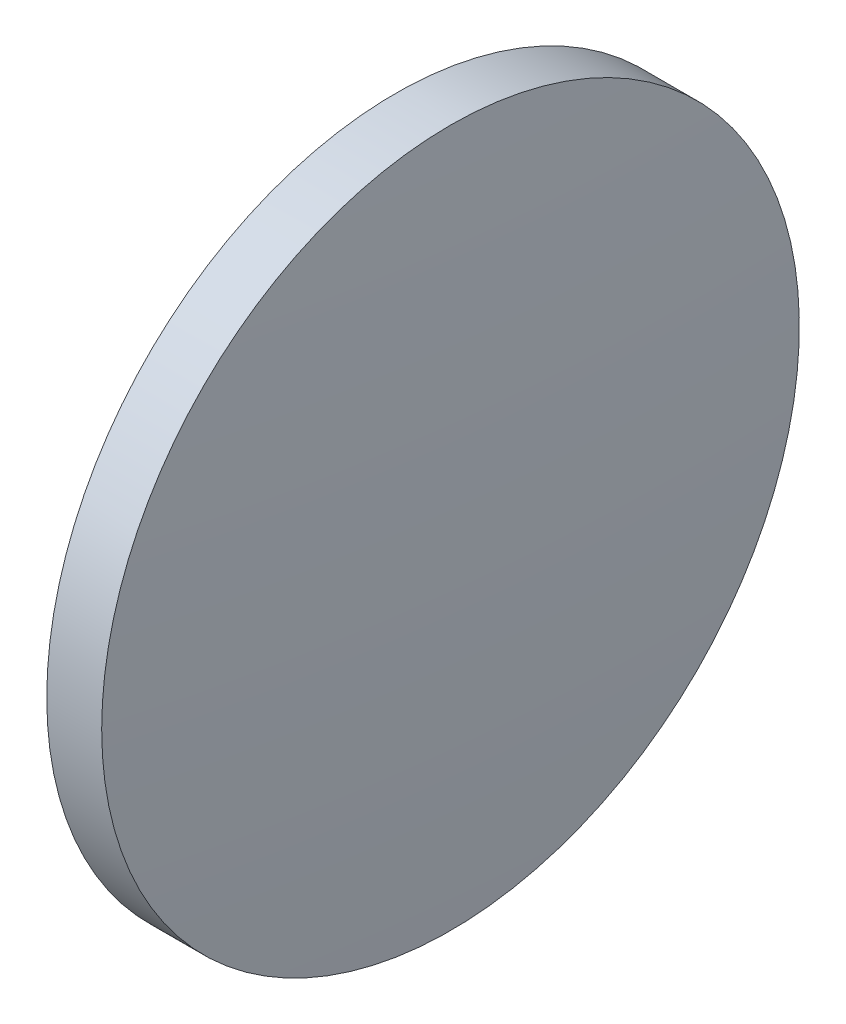
ISO-10303-21;
HEADER;
FILE_DESCRIPTION(('STEP AP214'),'2;1');
FILE_NAME('part.step','',(''),(''),'','','');
FILE_SCHEMA(('AUTOMOTIVE_DESIGN { 1 0 10303 214 1 1 1 1 }'));
ENDSEC;
DATA;
#1=APPLICATION_CONTEXT('core data for automotive mechanical design processes');
#2=APPLICATION_PROTOCOL_DEFINITION('international standard','automotive_design',2000,#1);
#3=PRODUCT_CONTEXT('',#1,'mechanical');
#4=PRODUCT('Part','Part','',(#3));
#5=PRODUCT_RELATED_PRODUCT_CATEGORY('part','',(#4));
#6=PRODUCT_DEFINITION_FORMATION('','',#4);
#7=PRODUCT_DEFINITION_CONTEXT('part definition',#1,'design');
#8=PRODUCT_DEFINITION('design','',#6,#7);
#9=PRODUCT_DEFINITION_SHAPE('','',#8);
#10=(LENGTH_UNIT() NAMED_UNIT(*) SI_UNIT(.MILLI.,.METRE.));
#11=(NAMED_UNIT(*) PLANE_ANGLE_UNIT() SI_UNIT($,.RADIAN.));
#12=(NAMED_UNIT(*) SI_UNIT($,.STERADIAN.) SOLID_ANGLE_UNIT());
#13=UNCERTAINTY_MEASURE_WITH_UNIT(LENGTH_MEASURE(1.E-05),#10,'distance_accuracy_value','');
#14=(GEOMETRIC_REPRESENTATION_CONTEXT(3) GLOBAL_UNCERTAINTY_ASSIGNED_CONTEXT((#13)) GLOBAL_UNIT_ASSIGNED_CONTEXT((#10,
#11,#12)) REPRESENTATION_CONTEXT('',''));
#15=CARTESIAN_POINT('',(0.,0.,0.));
#16=DIRECTION('',(0.,0.,1.));
#17=DIRECTION('',(1.,0.,0.));
#18=AXIS2_PLACEMENT_3D('',#15,#16,#17);
#19=CARTESIAN_POINT('',(277.909586178634,184.577382555171,0.));
#20=DIRECTION('',(-1.,0.,0.));
#21=DIRECTION('',(0.,1.,0.));
#22=AXIS2_PLACEMENT_3D('',#19,#20,#21);
#23=SPHERICAL_SURFACE('',#22,201.812499999997);
#24=CARTESIAN_POINT('',(479.32208617863,184.577382555171,0.));
#25=DIRECTION('',(-1.,0.,0.));
#26=DIRECTION('',(0.,0.,1.));
#27=AXIS2_PLACEMENT_3D('',#24,#25,#26);
#28=CIRCLE('',#27,12.7);
#29=CARTESIAN_POINT('',(479.32208617863,184.577382555171,12.7));
#30=VERTEX_POINT('',#29);
#31=EDGE_CURVE('E10',#30,#30,#28,.T.);
#32=ORIENTED_EDGE('',*,*,#31,.F.);
#33=EDGE_LOOP('',(#32));
#34=FACE_BOUND('',#33,.T.);
#35=ADVANCED_FACE('F35',(#34),#23,.T.);
#36=CARTESIAN_POINT('',(471.583868142954,184.577382555171,0.));
#37=DIRECTION('',(-1.,0.,0.));
#38=DIRECTION('',(0.,0.,1.));
#39=AXIS2_PLACEMENT_3D('',#36,#37,#38);
#40=CYLINDRICAL_SURFACE('',#39,12.7);
#41=CARTESIAN_POINT('',(477.32208617863,184.577382555171,0.));
#42=DIRECTION('',(-1.,0.,0.));
#43=DIRECTION('',(0.,0.,1.));
#44=AXIS2_PLACEMENT_3D('',#41,#42,#43);
#45=CIRCLE('',#44,12.7);
#46=CARTESIAN_POINT('',(477.32208617863,184.577382555171,12.7));
#47=VERTEX_POINT('',#46);
#48=EDGE_CURVE('E41',#47,#47,#45,.T.);
#49=ORIENTED_EDGE('',*,*,#48,.F.);
#50=EDGE_LOOP('',(#49));
#51=FACE_BOUND('',#50,.T.);
#52=ORIENTED_EDGE('',*,*,#31,.T.);
#53=EDGE_LOOP('',(#52));
#54=FACE_BOUND('',#53,.T.);
#55=ADVANCED_FACE('F49',(#51,#54),#40,.T.);
#56=CARTESIAN_POINT('',(477.32208617863,184.577382555171,0.));
#57=DIRECTION('',(1.,0.,0.));
#58=DIRECTION('',(0.,0.,-1.));
#59=AXIS2_PLACEMENT_3D('',#56,#57,#58);
#60=PLANE('',#59);
#61=ORIENTED_EDGE('',*,*,#48,.T.);
#62=EDGE_LOOP('',(#61));
#63=FACE_BOUND('',#62,.T.);
#64=ADVANCED_FACE('F47',(#63),#60,.F.);
#65=CLOSED_SHELL('',(#35,#55,#64));
#66=MANIFOLD_SOLID_BREP('B2',#65);
#67=ADVANCED_BREP_SHAPE_REPRESENTATION('',(#18,#66),#14);
#68=SHAPE_DEFINITION_REPRESENTATION(#9,#67);
ENDSEC;
END-ISO-10303-21;
